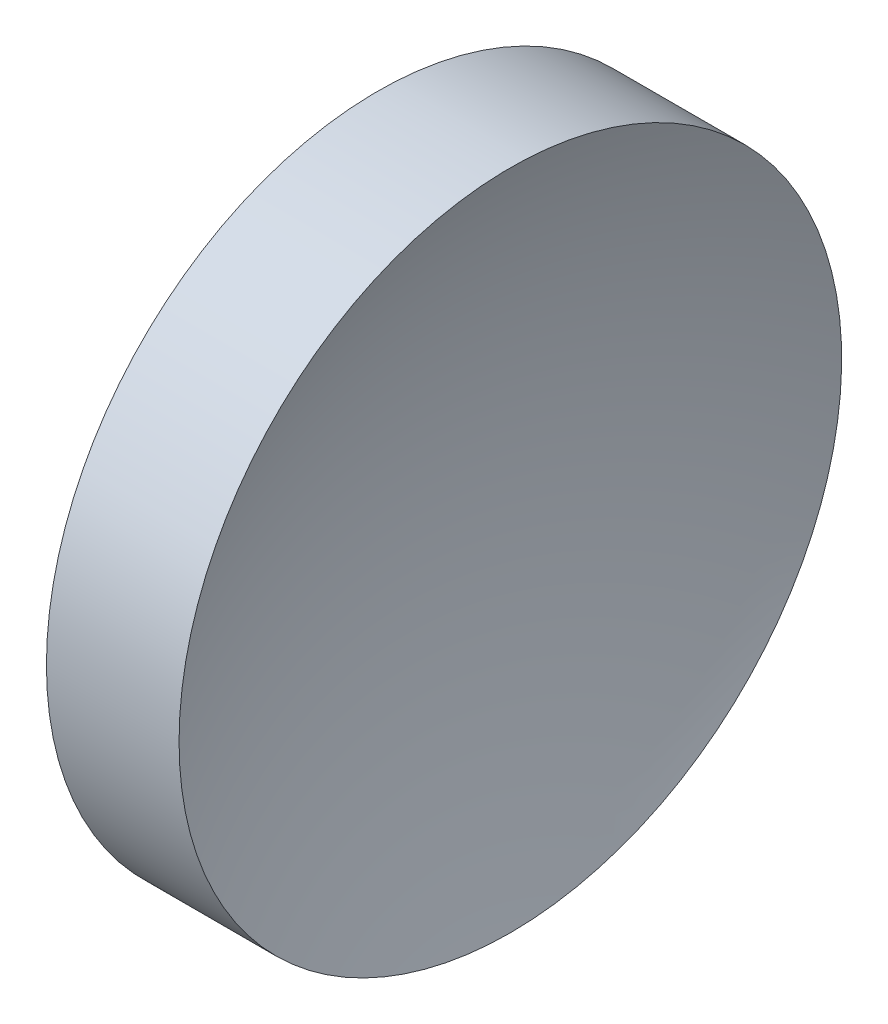
ISO-10303-21;
HEADER;
FILE_DESCRIPTION(('STEP AP214'),'2;1');
FILE_NAME('part.step','',(''),(''),'','','');
FILE_SCHEMA(('AUTOMOTIVE_DESIGN { 1 0 10303 214 1 1 1 1 }'));
ENDSEC;
DATA;
#1=APPLICATION_CONTEXT('core data for automotive mechanical design processes');
#2=APPLICATION_PROTOCOL_DEFINITION('international standard','automotive_design',2000,#1);
#3=PRODUCT_CONTEXT('',#1,'mechanical');
#4=PRODUCT('Part','Part','',(#3));
#5=PRODUCT_RELATED_PRODUCT_CATEGORY('part','',(#4));
#6=PRODUCT_DEFINITION_FORMATION('','',#4);
#7=PRODUCT_DEFINITION_CONTEXT('part definition',#1,'design');
#8=PRODUCT_DEFINITION('design','',#6,#7);
#9=PRODUCT_DEFINITION_SHAPE('','',#8);
#10=(LENGTH_UNIT() NAMED_UNIT(*) SI_UNIT(.MILLI.,.METRE.));
#11=(NAMED_UNIT(*) PLANE_ANGLE_UNIT() SI_UNIT($,.RADIAN.));
#12=(NAMED_UNIT(*) SI_UNIT($,.STERADIAN.) SOLID_ANGLE_UNIT());
#13=UNCERTAINTY_MEASURE_WITH_UNIT(LENGTH_MEASURE(1.E-05),#10,'distance_accuracy_value','');
#14=(GEOMETRIC_REPRESENTATION_CONTEXT(3) GLOBAL_UNCERTAINTY_ASSIGNED_CONTEXT((#13)) GLOBAL_UNIT_ASSIGNED_CONTEXT((#10,
#11,#12)) REPRESENTATION_CONTEXT('',''));
#15=CARTESIAN_POINT('',(0.,0.,0.));
#16=DIRECTION('',(0.,0.,1.));
#17=DIRECTION('',(1.,0.,0.));
#18=AXIS2_PLACEMENT_3D('',#15,#16,#17);
#19=CARTESIAN_POINT('',(154.506834178548,71.1939890865937,0.));
#20=DIRECTION('',(-1.,0.,0.));
#21=DIRECTION('',(0.,-1.,0.));
#22=AXIS2_PLACEMENT_3D('',#19,#20,#21);
#23=SPHERICAL_SURFACE('',#22,32.5);
#24=CARTESIAN_POINT('',(124.590952108985,71.1939890865937,0.));
#25=DIRECTION('',(-1.,0.,0.));
#26=DIRECTION('',(0.,0.,1.));
#27=AXIS2_PLACEMENT_3D('',#24,#25,#26);
#28=CIRCLE('',#27,12.7);
#29=CARTESIAN_POINT('',(124.590952108985,71.1939890865937,12.7));
#30=VERTEX_POINT('',#29);
#31=EDGE_CURVE('E10',#30,#30,#28,.T.);
#32=ORIENTED_EDGE('',*,*,#31,.F.);
#33=EDGE_LOOP('',(#32));
#34=FACE_BOUND('',#33,.T.);
#35=ADVANCED_FACE('F35',(#34),#23,.F.);
#36=CARTESIAN_POINT('',(111.955229757561,71.1939890865937,0.));
#37=DIRECTION('',(-1.,0.,0.));
#38=DIRECTION('',(0.,0.,1.));
#39=AXIS2_PLACEMENT_3D('',#36,#37,#38);
#40=CYLINDRICAL_SURFACE('',#39,12.7);
#41=CARTESIAN_POINT('',(119.506834178548,71.1939890865937,0.));
#42=DIRECTION('',(-1.,0.,0.));
#43=DIRECTION('',(0.,0.,1.));
#44=AXIS2_PLACEMENT_3D('',#41,#42,#43);
#45=CIRCLE('',#44,12.7);
#46=CARTESIAN_POINT('',(119.506834178548,71.1939890865937,12.7));
#47=VERTEX_POINT('',#46);
#48=EDGE_CURVE('E41',#47,#47,#45,.T.);
#49=ORIENTED_EDGE('',*,*,#48,.F.);
#50=EDGE_LOOP('',(#49));
#51=FACE_BOUND('',#50,.T.);
#52=ORIENTED_EDGE('',*,*,#31,.T.);
#53=EDGE_LOOP('',(#52));
#54=FACE_BOUND('',#53,.T.);
#55=ADVANCED_FACE('F49',(#51,#54),#40,.T.);
#56=CARTESIAN_POINT('',(119.506834178548,71.1939890865937,0.));
#57=DIRECTION('',(1.,0.,0.));
#58=DIRECTION('',(0.,0.,-1.));
#59=AXIS2_PLACEMENT_3D('',#56,#57,#58);
#60=PLANE('',#59);
#61=ORIENTED_EDGE('',*,*,#48,.T.);
#62=EDGE_LOOP('',(#61));
#63=FACE_BOUND('',#62,.T.);
#64=ADVANCED_FACE('F47',(#63),#60,.F.);
#65=CLOSED_SHELL('',(#35,#55,#64));
#66=MANIFOLD_SOLID_BREP('B2',#65);
#67=ADVANCED_BREP_SHAPE_REPRESENTATION('',(#18,#66),#14);
#68=SHAPE_DEFINITION_REPRESENTATION(#9,#67);
ENDSEC;
END-ISO-10303-21;
